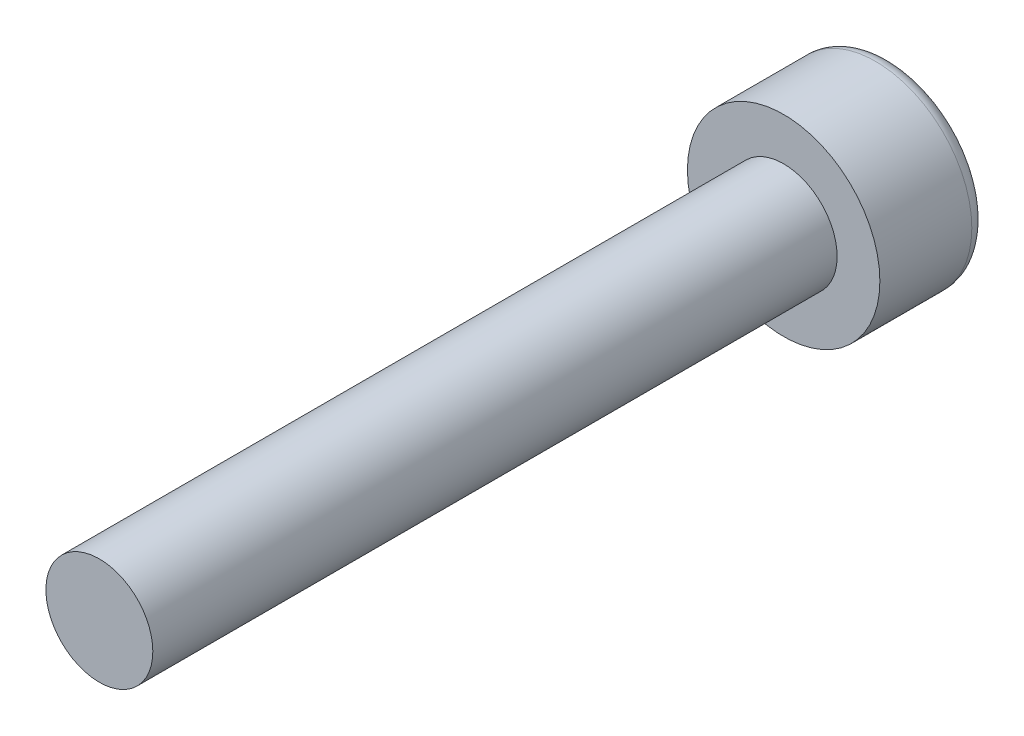
ISO-10303-21;
HEADER;
FILE_DESCRIPTION(('STEP AP214'),'2;1');
FILE_NAME('part.step','',(''),(''),'','','');
FILE_SCHEMA(('AUTOMOTIVE_DESIGN { 1 0 10303 214 1 1 1 1 }'));
ENDSEC;
DATA;
#1=APPLICATION_CONTEXT('core data for automotive mechanical design processes');
#2=APPLICATION_PROTOCOL_DEFINITION('international standard','automotive_design',2000,#1);
#3=PRODUCT_CONTEXT('',#1,'mechanical');
#4=PRODUCT('Part','Part','',(#3));
#5=PRODUCT_RELATED_PRODUCT_CATEGORY('part','',(#4));
#6=PRODUCT_DEFINITION_FORMATION('','',#4);
#7=PRODUCT_DEFINITION_CONTEXT('part definition',#1,'design');
#8=PRODUCT_DEFINITION('design','',#6,#7);
#9=PRODUCT_DEFINITION_SHAPE('','',#8);
#10=(LENGTH_UNIT() NAMED_UNIT(*) SI_UNIT(.MILLI.,.METRE.));
#11=(NAMED_UNIT(*) PLANE_ANGLE_UNIT() SI_UNIT($,.RADIAN.));
#12=(NAMED_UNIT(*) SI_UNIT($,.STERADIAN.) SOLID_ANGLE_UNIT());
#13=UNCERTAINTY_MEASURE_WITH_UNIT(LENGTH_MEASURE(1.E-05),#10,'distance_accuracy_value','');
#14=(GEOMETRIC_REPRESENTATION_CONTEXT(3) GLOBAL_UNCERTAINTY_ASSIGNED_CONTEXT((#13)) GLOBAL_UNIT_ASSIGNED_CONTEXT((#10,
#11,#12)) REPRESENTATION_CONTEXT('',''));
#15=CARTESIAN_POINT('',(0.,0.,0.));
#16=DIRECTION('',(0.,0.,1.));
#17=DIRECTION('',(1.,0.,0.));
#18=AXIS2_PLACEMENT_3D('',#15,#16,#17);
#19=CARTESIAN_POINT('',(0.,0.,16.));
#20=DIRECTION('',(0.,0.,-1.));
#21=DIRECTION('',(-1.,0.,0.));
#22=AXIS2_PLACEMENT_3D('',#19,#20,#21);
#23=CYLINDRICAL_SURFACE('',#22,1.25);
#24=CARTESIAN_POINT('',(0.,0.,16.));
#25=DIRECTION('',(0.,0.,1.));
#26=DIRECTION('',(1.,0.,0.));
#27=AXIS2_PLACEMENT_3D('',#24,#25,#26);
#28=CIRCLE('',#27,1.25);
#29=CARTESIAN_POINT('',(1.25,0.,16.));
#30=VERTEX_POINT('',#29);
#31=EDGE_CURVE('E145',#30,#30,#28,.T.);
#32=ORIENTED_EDGE('',*,*,#31,.F.);
#33=EDGE_LOOP('',(#32));
#34=FACE_BOUND('',#33,.T.);
#35=CARTESIAN_POINT('',(0.,0.,0.));
#36=DIRECTION('',(0.,0.,1.));
#37=DIRECTION('',(1.,0.,0.));
#38=AXIS2_PLACEMENT_3D('',#35,#36,#37);
#39=CIRCLE('',#38,1.25);
#40=CARTESIAN_POINT('',(1.25,0.,0.));
#41=VERTEX_POINT('',#40);
#42=EDGE_CURVE('E144',#41,#41,#39,.T.);
#43=ORIENTED_EDGE('',*,*,#42,.T.);
#44=EDGE_LOOP('',(#43));
#45=FACE_BOUND('',#44,.T.);
#46=ADVANCED_FACE('F34',(#34,#45),#23,.T.);
#47=CARTESIAN_POINT('',(0.,0.,16.));
#48=DIRECTION('',(0.,0.,1.));
#49=DIRECTION('',(1.,0.,0.));
#50=AXIS2_PLACEMENT_3D('',#47,#48,#49);
#51=PLANE('',#50);
#52=ORIENTED_EDGE('',*,*,#31,.T.);
#53=EDGE_LOOP('',(#52));
#54=FACE_BOUND('',#53,.T.);
#55=ADVANCED_FACE('F164',(#54),#51,.T.);
#56=CARTESIAN_POINT('',(0.,0.,-2.5));
#57=DIRECTION('',(0.,0.,1.));
#58=DIRECTION('',(1.,0.,0.));
#59=AXIS2_PLACEMENT_3D('',#56,#57,#58);
#60=CYLINDRICAL_SURFACE('',#59,2.25);
#61=CARTESIAN_POINT('',(0.,0.,-2.15));
#62=DIRECTION('',(0.,0.,-1.));
#63=DIRECTION('',(-1.,0.,0.));
#64=AXIS2_PLACEMENT_3D('',#61,#62,#63);
#65=CIRCLE('',#64,2.25);
#66=CARTESIAN_POINT('',(-2.25,0.,-2.15));
#67=VERTEX_POINT('',#66);
#68=EDGE_CURVE('E11',#67,#67,#65,.F.);
#69=ORIENTED_EDGE('',*,*,#68,.T.);
#70=EDGE_LOOP('',(#69));
#71=FACE_BOUND('',#70,.T.);
#72=CARTESIAN_POINT('',(0.,0.,0.));
#73=DIRECTION('',(0.,0.,-1.));
#74=DIRECTION('',(-1.,0.,0.));
#75=AXIS2_PLACEMENT_3D('',#72,#73,#74);
#76=CIRCLE('',#75,2.25);
#77=CARTESIAN_POINT('',(-2.25,0.,0.));
#78=VERTEX_POINT('',#77);
#79=EDGE_CURVE('E136',#78,#78,#76,.T.);
#80=ORIENTED_EDGE('',*,*,#79,.T.);
#81=EDGE_LOOP('',(#80));
#82=FACE_BOUND('',#81,.T.);
#83=ADVANCED_FACE('F169',(#71,#82),#60,.T.);
#84=CARTESIAN_POINT('',(0.,0.,-2.5));
#85=DIRECTION('',(0.,0.,-1.));
#86=DIRECTION('',(-1.,0.,0.));
#87=AXIS2_PLACEMENT_3D('',#84,#85,#86);
#88=PLANE('',#87);
#89=CARTESIAN_POINT('',(0.,0.,-2.5));
#90=DIRECTION('',(0.,0.,-1.));
#91=DIRECTION('',(-1.,0.,0.));
#92=AXIS2_PLACEMENT_3D('',#89,#90,#91);
#93=CIRCLE('',#92,1.9);
#94=CARTESIAN_POINT('',(-1.9,0.,-2.5));
#95=VERTEX_POINT('',#94);
#96=EDGE_CURVE('E42',#95,#95,#93,.T.);
#97=ORIENTED_EDGE('',*,*,#96,.T.);
#98=EDGE_LOOP('',(#97));
#99=FACE_BOUND('',#98,.T.);
#100=DIRECTION('',(-0.866025403784439,-0.5,0.));
#101=VECTOR('',#100,1.);
#102=CARTESIAN_POINT('',(1.,-0.577350269189626,-2.5));
#103=LINE('',#102,#101);
#104=CARTESIAN_POINT('',(1.,-0.577350269189626,-2.5));
#105=VERTEX_POINT('',#104);
#106=CARTESIAN_POINT('',(0.,-1.15470053837925,-2.5));
#107=VERTEX_POINT('',#106);
#108=EDGE_CURVE('E49',#105,#107,#103,.T.);
#109=ORIENTED_EDGE('',*,*,#108,.F.);
#110=DIRECTION('',(0.,-1.,0.));
#111=VECTOR('',#110,1.);
#112=CARTESIAN_POINT('',(1.,0.577350269189626,-2.5));
#113=LINE('',#112,#111);
#114=CARTESIAN_POINT('',(1.,0.577350269189626,-2.5));
#115=VERTEX_POINT('',#114);
#116=EDGE_CURVE('E132',#115,#105,#113,.T.);
#117=ORIENTED_EDGE('',*,*,#116,.F.);
#118=DIRECTION('',(0.866025403784439,-0.5,0.));
#119=VECTOR('',#118,1.);
#120=CARTESIAN_POINT('',(0.,1.15470053837925,-2.5));
#121=LINE('',#120,#119);
#122=CARTESIAN_POINT('',(0.,1.15470053837925,-2.5));
#123=VERTEX_POINT('',#122);
#124=EDGE_CURVE('E130',#123,#115,#121,.T.);
#125=ORIENTED_EDGE('',*,*,#124,.F.);
#126=DIRECTION('',(0.866025403784439,0.5,0.));
#127=VECTOR('',#126,1.);
#128=CARTESIAN_POINT('',(-1.,0.577350269189626,-2.5));
#129=LINE('',#128,#127);
#130=CARTESIAN_POINT('',(-1.,0.577350269189626,-2.5));
#131=VERTEX_POINT('',#130);
#132=EDGE_CURVE('E97',#131,#123,#129,.T.);
#133=ORIENTED_EDGE('',*,*,#132,.F.);
#134=DIRECTION('',(0.,1.,0.));
#135=VECTOR('',#134,1.);
#136=CARTESIAN_POINT('',(-1.,-0.577350269189626,-2.5));
#137=LINE('',#136,#135);
#138=CARTESIAN_POINT('',(-1.,-0.577350269189626,-2.5));
#139=VERTEX_POINT('',#138);
#140=EDGE_CURVE('E126',#139,#131,#137,.T.);
#141=ORIENTED_EDGE('',*,*,#140,.F.);
#142=DIRECTION('',(-0.866025403784438,0.5,0.));
#143=VECTOR('',#142,1.);
#144=CARTESIAN_POINT('',(0.,-1.15470053837925,-2.5));
#145=LINE('',#144,#143);
#146=EDGE_CURVE('E123',#107,#139,#145,.T.);
#147=ORIENTED_EDGE('',*,*,#146,.F.);
#148=EDGE_LOOP('',(#109,#117,#125,#133,#141,#147));
#149=FACE_BOUND('',#148,.T.);
#150=ADVANCED_FACE('F152',(#99,#149),#88,.T.);
#151=CARTESIAN_POINT('',(0.,0.,0.));
#152=DIRECTION('',(0.,0.,-1.));
#153=DIRECTION('',(-1.,0.,0.));
#154=AXIS2_PLACEMENT_3D('',#151,#152,#153);
#155=PLANE('',#154);
#156=ORIENTED_EDGE('',*,*,#42,.F.);
#157=EDGE_LOOP('',(#156));
#158=FACE_BOUND('',#157,.T.);
#159=ORIENTED_EDGE('',*,*,#79,.F.);
#160=EDGE_LOOP('',(#159));
#161=FACE_BOUND('',#160,.T.);
#162=ADVANCED_FACE('F178',(#158,#161),#155,.F.);
#163=CARTESIAN_POINT('',(1.,-0.577350269189626,-1.));
#164=DIRECTION('',(0.5,-0.866025403784438,0.));
#165=DIRECTION('',(0.866025403784439,0.5,0.));
#166=AXIS2_PLACEMENT_3D('',#163,#164,#165);
#167=PLANE('',#166);
#168=ORIENTED_EDGE('',*,*,#108,.T.);
#169=DIRECTION('',(0.,0.,-1.));
#170=VECTOR('',#169,1.);
#171=CARTESIAN_POINT('',(0.,-1.15470053837925,-1.));
#172=LINE('',#171,#170);
#173=CARTESIAN_POINT('',(0.,-1.15470053837925,-1.));
#174=VERTEX_POINT('',#173);
#175=EDGE_CURVE('E79',#174,#107,#172,.T.);
#176=ORIENTED_EDGE('',*,*,#175,.F.);
#177=DIRECTION('',(-0.866025403784439,-0.5,0.));
#178=VECTOR('',#177,1.);
#179=CARTESIAN_POINT('',(1.,-0.577350269189626,-1.));
#180=LINE('',#179,#178);
#181=CARTESIAN_POINT('',(1.,-0.577350269189626,-1.));
#182=VERTEX_POINT('',#181);
#183=EDGE_CURVE('E134',#182,#174,#180,.T.);
#184=ORIENTED_EDGE('',*,*,#183,.F.);
#185=DIRECTION('',(0.,0.,-1.));
#186=VECTOR('',#185,1.);
#187=CARTESIAN_POINT('',(1.,-0.577350269189626,-1.));
#188=LINE('',#187,#186);
#189=EDGE_CURVE('E57',#182,#105,#188,.T.);
#190=ORIENTED_EDGE('',*,*,#189,.T.);
#191=EDGE_LOOP('',(#168,#176,#184,#190));
#192=FACE_BOUND('',#191,.T.);
#193=ADVANCED_FACE('F181',(#192),#167,.F.);
#194=CARTESIAN_POINT('',(1.,0.577350269189626,-1.));
#195=DIRECTION('',(1.,0.,0.));
#196=DIRECTION('',(0.,1.,0.));
#197=AXIS2_PLACEMENT_3D('',#194,#195,#196);
#198=PLANE('',#197);
#199=ORIENTED_EDGE('',*,*,#116,.T.);
#200=ORIENTED_EDGE('',*,*,#189,.F.);
#201=DIRECTION('',(0.,-1.,0.));
#202=VECTOR('',#201,1.);
#203=CARTESIAN_POINT('',(1.,0.577350269189626,-1.));
#204=LINE('',#203,#202);
#205=CARTESIAN_POINT('',(1.,0.577350269189626,-1.));
#206=VERTEX_POINT('',#205);
#207=EDGE_CURVE('E109',#206,#182,#204,.T.);
#208=ORIENTED_EDGE('',*,*,#207,.F.);
#209=DIRECTION('',(0.,0.,-1.));
#210=VECTOR('',#209,1.);
#211=CARTESIAN_POINT('',(1.,0.577350269189626,-1.));
#212=LINE('',#211,#210);
#213=EDGE_CURVE('E101',#206,#115,#212,.T.);
#214=ORIENTED_EDGE('',*,*,#213,.T.);
#215=EDGE_LOOP('',(#199,#200,#208,#214));
#216=FACE_BOUND('',#215,.T.);
#217=ADVANCED_FACE('F187',(#216),#198,.F.);
#218=CARTESIAN_POINT('',(0.,1.15470053837925,-1.));
#219=DIRECTION('',(0.5,0.866025403784439,0.));
#220=DIRECTION('',(-0.866025403784439,0.5,0.));
#221=AXIS2_PLACEMENT_3D('',#218,#219,#220);
#222=PLANE('',#221);
#223=ORIENTED_EDGE('',*,*,#124,.T.);
#224=ORIENTED_EDGE('',*,*,#213,.F.);
#225=DIRECTION('',(0.866025403784439,-0.5,0.));
#226=VECTOR('',#225,1.);
#227=CARTESIAN_POINT('',(0.,1.15470053837925,-1.));
#228=LINE('',#227,#226);
#229=CARTESIAN_POINT('',(0.,1.15470053837925,-1.));
#230=VERTEX_POINT('',#229);
#231=EDGE_CURVE('E105',#230,#206,#228,.T.);
#232=ORIENTED_EDGE('',*,*,#231,.F.);
#233=DIRECTION('',(0.,0.,-1.));
#234=VECTOR('',#233,1.);
#235=CARTESIAN_POINT('',(0.,1.15470053837925,-1.));
#236=LINE('',#235,#234);
#237=EDGE_CURVE('E90',#230,#123,#236,.T.);
#238=ORIENTED_EDGE('',*,*,#237,.T.);
#239=EDGE_LOOP('',(#223,#224,#232,#238));
#240=FACE_BOUND('',#239,.T.);
#241=ADVANCED_FACE('F106',(#240),#222,.F.);
#242=CARTESIAN_POINT('',(-1.,0.577350269189626,-1.));
#243=DIRECTION('',(-0.5,0.866025403784439,0.));
#244=DIRECTION('',(-0.866025403784439,-0.5,0.));
#245=AXIS2_PLACEMENT_3D('',#242,#243,#244);
#246=PLANE('',#245);
#247=ORIENTED_EDGE('',*,*,#132,.T.);
#248=ORIENTED_EDGE('',*,*,#237,.F.);
#249=DIRECTION('',(0.866025403784439,0.5,0.));
#250=VECTOR('',#249,1.);
#251=CARTESIAN_POINT('',(-1.,0.577350269189626,-1.));
#252=LINE('',#251,#250);
#253=CARTESIAN_POINT('',(-1.,0.577350269189626,-1.));
#254=VERTEX_POINT('',#253);
#255=EDGE_CURVE('E94',#254,#230,#252,.T.);
#256=ORIENTED_EDGE('',*,*,#255,.F.);
#257=DIRECTION('',(0.,0.,-1.));
#258=VECTOR('',#257,1.);
#259=CARTESIAN_POINT('',(-1.,0.577350269189626,-1.));
#260=LINE('',#259,#258);
#261=EDGE_CURVE('E102',#254,#131,#260,.T.);
#262=ORIENTED_EDGE('',*,*,#261,.T.);
#263=EDGE_LOOP('',(#247,#248,#256,#262));
#264=FACE_BOUND('',#263,.T.);
#265=ADVANCED_FACE('F92',(#264),#246,.F.);
#266=CARTESIAN_POINT('',(-1.,-0.577350269189626,-1.));
#267=DIRECTION('',(-1.,0.,0.));
#268=DIRECTION('',(0.,0.,1.));
#269=AXIS2_PLACEMENT_3D('',#266,#267,#268);
#270=PLANE('',#269);
#271=ORIENTED_EDGE('',*,*,#140,.T.);
#272=ORIENTED_EDGE('',*,*,#261,.F.);
#273=DIRECTION('',(0.,1.,0.));
#274=VECTOR('',#273,1.);
#275=CARTESIAN_POINT('',(-1.,-0.577350269189626,-1.));
#276=LINE('',#275,#274);
#277=CARTESIAN_POINT('',(-1.,-0.577350269189626,-1.));
#278=VERTEX_POINT('',#277);
#279=EDGE_CURVE('E115',#278,#254,#276,.T.);
#280=ORIENTED_EDGE('',*,*,#279,.F.);
#281=DIRECTION('',(0.,0.,-1.));
#282=VECTOR('',#281,1.);
#283=CARTESIAN_POINT('',(-1.,-0.577350269189626,-1.));
#284=LINE('',#283,#282);
#285=EDGE_CURVE('E139',#278,#139,#284,.T.);
#286=ORIENTED_EDGE('',*,*,#285,.T.);
#287=EDGE_LOOP('',(#271,#272,#280,#286));
#288=FACE_BOUND('',#287,.T.);
#289=ADVANCED_FACE('F190',(#288),#270,.F.);
#290=CARTESIAN_POINT('',(0.,-1.15470053837925,-1.));
#291=DIRECTION('',(-0.5,-0.866025403784439,0.));
#292=DIRECTION('',(0.866025403784439,-0.5,0.));
#293=AXIS2_PLACEMENT_3D('',#290,#291,#292);
#294=PLANE('',#293);
#295=ORIENTED_EDGE('',*,*,#146,.T.);
#296=ORIENTED_EDGE('',*,*,#285,.F.);
#297=DIRECTION('',(-0.866025403784438,0.5,0.));
#298=VECTOR('',#297,1.);
#299=CARTESIAN_POINT('',(0.,-1.15470053837925,-1.));
#300=LINE('',#299,#298);
#301=EDGE_CURVE('E117',#174,#278,#300,.T.);
#302=ORIENTED_EDGE('',*,*,#301,.F.);
#303=ORIENTED_EDGE('',*,*,#175,.T.);
#304=EDGE_LOOP('',(#295,#296,#302,#303));
#305=FACE_BOUND('',#304,.T.);
#306=ADVANCED_FACE('F160',(#305),#294,.F.);
#307=CARTESIAN_POINT('',(0.,0.,-1.));
#308=DIRECTION('',(0.,0.,-1.));
#309=DIRECTION('',(-1.,0.,0.));
#310=AXIS2_PLACEMENT_3D('',#307,#308,#309);
#311=PLANE('',#310);
#312=ORIENTED_EDGE('',*,*,#183,.T.);
#313=ORIENTED_EDGE('',*,*,#301,.T.);
#314=ORIENTED_EDGE('',*,*,#279,.T.);
#315=ORIENTED_EDGE('',*,*,#255,.T.);
#316=ORIENTED_EDGE('',*,*,#231,.T.);
#317=ORIENTED_EDGE('',*,*,#207,.T.);
#318=EDGE_LOOP('',(#312,#313,#314,#315,#316,#317));
#319=FACE_BOUND('',#318,.T.);
#320=ADVANCED_FACE('F112',(#319),#311,.T.);
#321=CARTESIAN_POINT('',(0.,0.,-2.15));
#322=DIRECTION('',(0.,0.,-1.));
#323=DIRECTION('',(-1.,0.,0.));
#324=AXIS2_PLACEMENT_3D('',#321,#322,#323);
#325=TOROIDAL_SURFACE('',#324,1.9,0.35);
#326=ORIENTED_EDGE('',*,*,#68,.F.);
#327=EDGE_LOOP('',(#326));
#328=FACE_BOUND('',#327,.T.);
#329=ORIENTED_EDGE('',*,*,#96,.F.);
#330=EDGE_LOOP('',(#329));
#331=FACE_BOUND('',#330,.T.);
#332=ADVANCED_FACE('F36',(#328,#331),#325,.T.);
#333=CLOSED_SHELL('',(#46,#55,#83,#150,#162,#193,#217,#241,#265,#289,#306,#320,#332));
#334=MANIFOLD_SOLID_BREP('B2',#333);
#335=ADVANCED_BREP_SHAPE_REPRESENTATION('',(#18,#334),#14);
#336=SHAPE_DEFINITION_REPRESENTATION(#9,#335);
ENDSEC;
END-ISO-10303-21;
